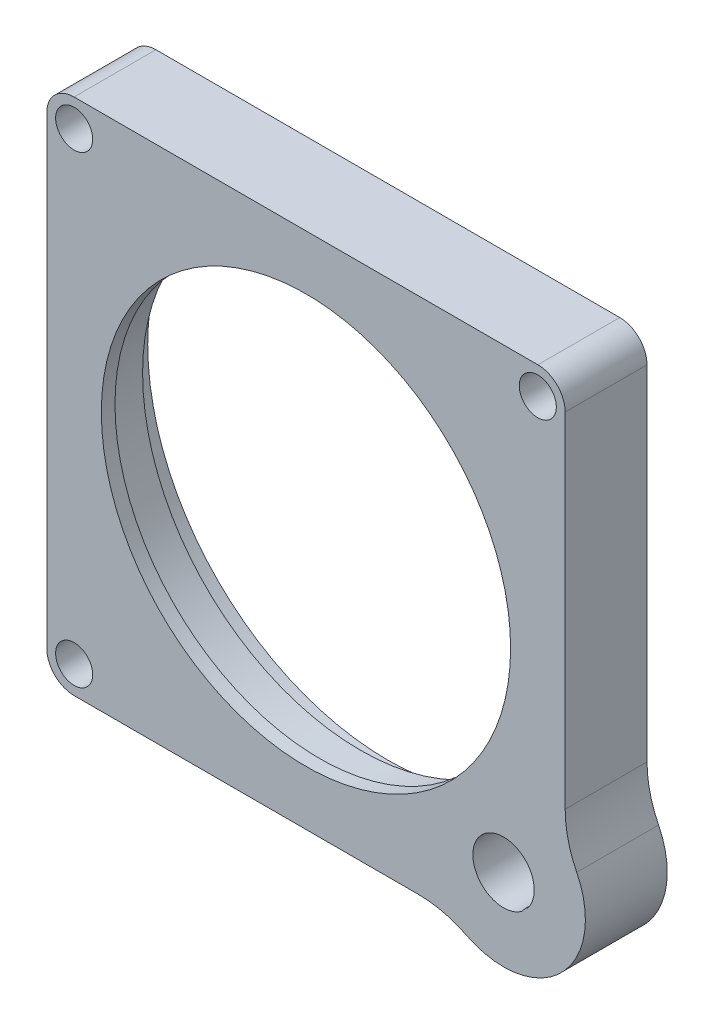
ISO-10303-21;
HEADER;
FILE_DESCRIPTION(('STEP AP214'),'2;1');
FILE_NAME('part.step','',(''),(''),'','','');
FILE_SCHEMA(('AUTOMOTIVE_DESIGN { 1 0 10303 214 1 1 1 1 }'));
ENDSEC;
DATA;
#1=APPLICATION_CONTEXT('core data for automotive mechanical design processes');
#2=APPLICATION_PROTOCOL_DEFINITION('international standard','automotive_design',2000,#1);
#3=PRODUCT_CONTEXT('',#1,'mechanical');
#4=PRODUCT('Part','Part','',(#3));
#5=PRODUCT_RELATED_PRODUCT_CATEGORY('part','',(#4));
#6=PRODUCT_DEFINITION_FORMATION('','',#4);
#7=PRODUCT_DEFINITION_CONTEXT('part definition',#1,'design');
#8=PRODUCT_DEFINITION('design','',#6,#7);
#9=PRODUCT_DEFINITION_SHAPE('','',#8);
#10=(LENGTH_UNIT() NAMED_UNIT(*) SI_UNIT(.MILLI.,.METRE.));
#11=(NAMED_UNIT(*) PLANE_ANGLE_UNIT() SI_UNIT($,.RADIAN.));
#12=(NAMED_UNIT(*) SI_UNIT($,.STERADIAN.) SOLID_ANGLE_UNIT());
#13=UNCERTAINTY_MEASURE_WITH_UNIT(LENGTH_MEASURE(1.E-05),#10,'distance_accuracy_value','');
#14=(GEOMETRIC_REPRESENTATION_CONTEXT(3) GLOBAL_UNCERTAINTY_ASSIGNED_CONTEXT((#13)) GLOBAL_UNIT_ASSIGNED_CONTEXT((#10,
#11,#12)) REPRESENTATION_CONTEXT('',''));
#15=CARTESIAN_POINT('',(0.,0.,0.));
#16=DIRECTION('',(0.,0.,1.));
#17=DIRECTION('',(1.,0.,0.));
#18=AXIS2_PLACEMENT_3D('',#15,#16,#17);
#19=CARTESIAN_POINT('',(22.9894556699369,-22.9894556699372,9.525));
#20=DIRECTION('',(0.,0.,1.));
#21=DIRECTION('',(1.,0.,0.));
#22=AXIS2_PLACEMENT_3D('',#19,#20,#21);
#23=CYLINDRICAL_SURFACE('',#22,3.57124);
#24=CARTESIAN_POINT('',(22.9894556699369,-22.9894556699372,3.2004));
#25=DIRECTION('',(0.,0.,-1.));
#26=DIRECTION('',(-1.,0.,0.));
#27=AXIS2_PLACEMENT_3D('',#24,#25,#26);
#28=CIRCLE('',#27,3.57124);
#29=CARTESIAN_POINT('',(25.8437712750575,-25.1357635611692,3.2004));
#30=VERTEX_POINT('',#29);
#31=CARTESIAN_POINT('',(25.1357635611654,-25.8437712750604,3.2004));
#32=VERTEX_POINT('',#31);
#33=EDGE_CURVE('E158',#30,#32,#28,.F.);
#34=ORIENTED_EDGE('',*,*,#33,.F.);
#35=DIRECTION('',(0.,0.,1.));
#36=VECTOR('',#35,1.);
#37=CARTESIAN_POINT('',(25.8437712750575,-25.1357635611692,4.7625));
#38=LINE('',#37,#36);
#39=CARTESIAN_POINT('',(25.8437712750575,-25.1357635611692,9.525));
#40=VERTEX_POINT('',#39);
#41=EDGE_CURVE('E166',#30,#40,#38,.T.);
#42=ORIENTED_EDGE('',*,*,#41,.T.);
#43=CARTESIAN_POINT('',(22.9894556699369,-22.9894556699372,9.525));
#44=DIRECTION('',(0.,0.,1.));
#45=DIRECTION('',(1.,0.,0.));
#46=AXIS2_PLACEMENT_3D('',#43,#44,#45);
#47=CIRCLE('',#46,3.57124);
#48=CARTESIAN_POINT('',(25.1357635611654,-25.8437712750604,9.525));
#49=VERTEX_POINT('',#48);
#50=EDGE_CURVE('E180',#40,#49,#47,.T.);
#51=ORIENTED_EDGE('',*,*,#50,.T.);
#52=DIRECTION('',(0.,0.,1.));
#53=VECTOR('',#52,1.);
#54=CARTESIAN_POINT('',(25.1357635611654,-25.8437712750604,4.7625));
#55=LINE('',#54,#53);
#56=EDGE_CURVE('E168',#49,#32,#55,.F.);
#57=ORIENTED_EDGE('',*,*,#56,.T.);
#58=EDGE_LOOP('',(#34,#42,#51,#57));
#59=FACE_BOUND('',#58,.T.);
#60=ADVANCED_FACE('F44',(#59),#23,.F.);
#61=CARTESIAN_POINT('',(26.9747999999981,-26.9748000000032,0.));
#62=DIRECTION('',(0.,0.,1.));
#63=DIRECTION('',(1.,0.,0.));
#64=AXIS2_PLACEMENT_3D('',#61,#62,#63);
#65=CYLINDRICAL_SURFACE('',#64,2.159);
#66=ORIENTED_EDGE('',*,*,#41,.F.);
#67=CARTESIAN_POINT('',(26.9747999999981,-26.9748000000032,3.2004));
#68=DIRECTION('',(0.,0.,-1.));
#69=DIRECTION('',(-1.,0.,0.));
#70=AXIS2_PLACEMENT_3D('',#67,#68,#69);
#71=CIRCLE('',#70,2.159);
#72=EDGE_CURVE('E155',#30,#32,#71,.F.);
#73=ORIENTED_EDGE('',*,*,#72,.T.);
#74=ORIENTED_EDGE('',*,*,#56,.F.);
#75=CARTESIAN_POINT('',(26.9747999999981,-26.9748000000032,9.525));
#76=DIRECTION('',(0.,0.,1.));
#77=DIRECTION('',(1.,0.,0.));
#78=AXIS2_PLACEMENT_3D('',#75,#76,#77);
#79=CIRCLE('',#78,2.159);
#80=EDGE_CURVE('E173',#40,#49,#79,.T.);
#81=ORIENTED_EDGE('',*,*,#80,.F.);
#82=EDGE_LOOP('',(#66,#73,#74,#81));
#83=FACE_BOUND('',#82,.T.);
#84=ADVANCED_FACE('F171',(#83),#65,.T.);
#85=CARTESIAN_POINT('',(0.,0.,81.1874438461319));
#86=DIRECTION('',(0.,0.,-1.));
#87=DIRECTION('',(-1.,0.,0.));
#88=AXIS2_PLACEMENT_3D('',#85,#86,#87);
#89=CYLINDRICAL_SURFACE('',#88,25.3365);
#90=CARTESIAN_POINT('',(0.,0.,7.9375));
#91=DIRECTION('',(0.,0.,1.));
#92=DIRECTION('',(1.,0.,0.));
#93=AXIS2_PLACEMENT_3D('',#90,#91,#92);
#94=CIRCLE('',#93,25.3365);
#95=CARTESIAN_POINT('',(25.3365,0.,7.9375));
#96=VERTEX_POINT('',#95);
#97=EDGE_CURVE('E250',#96,#96,#94,.F.);
#98=ORIENTED_EDGE('',*,*,#97,.F.);
#99=EDGE_LOOP('',(#98));
#100=FACE_BOUND('',#99,.T.);
#101=CARTESIAN_POINT('',(0.,0.,3.20040000000001));
#102=DIRECTION('',(0.,0.,-1.));
#103=DIRECTION('',(-1.,0.,0.));
#104=AXIS2_PLACEMENT_3D('',#101,#102,#103);
#105=CIRCLE('',#104,25.3365);
#106=CARTESIAN_POINT('',(-25.3365,0.,3.20040000000001));
#107=VERTEX_POINT('',#106);
#108=EDGE_CURVE('E254',#107,#107,#105,.F.);
#109=ORIENTED_EDGE('',*,*,#108,.F.);
#110=EDGE_LOOP('',(#109));
#111=FACE_BOUND('',#110,.T.);
#112=ADVANCED_FACE('F361',(#100,#111),#89,.F.);
#113=CARTESIAN_POINT('',(26.9875000000011,26.9875,9.525));
#114=DIRECTION('',(0.,0.,-1.));
#115=DIRECTION('',(-1.,0.,0.));
#116=AXIS2_PLACEMENT_3D('',#113,#114,#115);
#117=CYLINDRICAL_SURFACE('',#116,3.175);
#118=CARTESIAN_POINT('',(26.9875000000011,26.9875,0.));
#119=DIRECTION('',(0.,0.,1.));
#120=DIRECTION('',(1.,0.,0.));
#121=AXIS2_PLACEMENT_3D('',#118,#119,#120);
#122=CIRCLE('',#121,3.175);
#123=CARTESIAN_POINT('',(26.9875000000011,30.1625,0.));
#124=VERTEX_POINT('',#123);
#125=CARTESIAN_POINT('',(30.1625000000011,26.9875,0.));
#126=VERTEX_POINT('',#125);
#127=EDGE_CURVE('E185',#124,#126,#122,.F.);
#128=ORIENTED_EDGE('',*,*,#127,.F.);
#129=DIRECTION('',(0.,0.,-1.));
#130=VECTOR('',#129,1.);
#131=CARTESIAN_POINT('',(26.9875000000011,30.1625,9.525));
#132=LINE('',#131,#130);
#133=CARTESIAN_POINT('',(26.9875000000011,30.1625,9.525));
#134=VERTEX_POINT('',#133);
#135=EDGE_CURVE('E248',#134,#124,#132,.T.);
#136=ORIENTED_EDGE('',*,*,#135,.F.);
#137=CARTESIAN_POINT('',(26.9875000000011,26.9875,9.525));
#138=DIRECTION('',(0.,0.,1.));
#139=DIRECTION('',(1.,0.,0.));
#140=AXIS2_PLACEMENT_3D('',#137,#138,#139);
#141=CIRCLE('',#140,3.175);
#142=CARTESIAN_POINT('',(30.1625000000011,26.9875,9.525));
#143=VERTEX_POINT('',#142);
#144=EDGE_CURVE('E187',#134,#143,#141,.F.);
#145=ORIENTED_EDGE('',*,*,#144,.T.);
#146=DIRECTION('',(0.,0.,-1.));
#147=VECTOR('',#146,1.);
#148=CARTESIAN_POINT('',(30.1625000000011,26.9875,9.525));
#149=LINE('',#148,#147);
#150=EDGE_CURVE('E213',#143,#126,#149,.T.);
#151=ORIENTED_EDGE('',*,*,#150,.T.);
#152=EDGE_LOOP('',(#128,#136,#145,#151));
#153=FACE_BOUND('',#152,.T.);
#154=ADVANCED_FACE('F478',(#153),#117,.T.);
#155=CARTESIAN_POINT('',(0.,30.1625,9.525));
#156=DIRECTION('',(0.,1.,0.));
#157=DIRECTION('',(0.,0.,1.));
#158=AXIS2_PLACEMENT_3D('',#155,#156,#157);
#159=PLANE('',#158);
#160=DIRECTION('',(1.,0.,0.));
#161=VECTOR('',#160,1.);
#162=CARTESIAN_POINT('',(0.,30.1625,0.));
#163=LINE('',#162,#161);
#164=CARTESIAN_POINT('',(-26.9875000000011,30.1625,0.));
#165=VERTEX_POINT('',#164);
#166=EDGE_CURVE('E216',#165,#124,#163,.T.);
#167=ORIENTED_EDGE('',*,*,#166,.F.);
#168=DIRECTION('',(0.,0.,-1.));
#169=VECTOR('',#168,1.);
#170=CARTESIAN_POINT('',(-26.9875000000011,30.1625,9.525));
#171=LINE('',#170,#169);
#172=CARTESIAN_POINT('',(-26.9875000000011,30.1625,9.525));
#173=VERTEX_POINT('',#172);
#174=EDGE_CURVE('E246',#173,#165,#171,.T.);
#175=ORIENTED_EDGE('',*,*,#174,.F.);
#176=DIRECTION('',(1.,0.,0.));
#177=VECTOR('',#176,1.);
#178=CARTESIAN_POINT('',(0.,30.1625,9.525));
#179=LINE('',#178,#177);
#180=EDGE_CURVE('E190',#173,#134,#179,.T.);
#181=ORIENTED_EDGE('',*,*,#180,.T.);
#182=ORIENTED_EDGE('',*,*,#135,.T.);
#183=EDGE_LOOP('',(#167,#175,#181,#182));
#184=FACE_BOUND('',#183,.T.);
#185=ADVANCED_FACE('F475',(#184),#159,.T.);
#186=CARTESIAN_POINT('',(-26.9875000000011,26.9875,9.525));
#187=DIRECTION('',(0.,0.,-1.));
#188=DIRECTION('',(-1.,0.,0.));
#189=AXIS2_PLACEMENT_3D('',#186,#187,#188);
#190=CYLINDRICAL_SURFACE('',#189,3.175);
#191=CARTESIAN_POINT('',(-26.9875000000011,26.9875,0.));
#192=DIRECTION('',(0.,0.,1.));
#193=DIRECTION('',(1.,0.,0.));
#194=AXIS2_PLACEMENT_3D('',#191,#192,#193);
#195=CIRCLE('',#194,3.175);
#196=CARTESIAN_POINT('',(-30.1625000000011,26.9875,0.));
#197=VERTEX_POINT('',#196);
#198=EDGE_CURVE('E219',#165,#197,#195,.T.);
#199=ORIENTED_EDGE('',*,*,#198,.T.);
#200=DIRECTION('',(0.,0.,-1.));
#201=VECTOR('',#200,1.);
#202=CARTESIAN_POINT('',(-30.1625000000011,26.9875,9.525));
#203=LINE('',#202,#201);
#204=CARTESIAN_POINT('',(-30.1625000000011,26.9875,9.525));
#205=VERTEX_POINT('',#204);
#206=EDGE_CURVE('E243',#205,#197,#203,.T.);
#207=ORIENTED_EDGE('',*,*,#206,.F.);
#208=CARTESIAN_POINT('',(-26.9875000000011,26.9875,9.525));
#209=DIRECTION('',(0.,0.,1.));
#210=DIRECTION('',(1.,0.,0.));
#211=AXIS2_PLACEMENT_3D('',#208,#209,#210);
#212=CIRCLE('',#211,3.175);
#213=EDGE_CURVE('E194',#173,#205,#212,.T.);
#214=ORIENTED_EDGE('',*,*,#213,.F.);
#215=ORIENTED_EDGE('',*,*,#174,.T.);
#216=EDGE_LOOP('',(#199,#207,#214,#215));
#217=FACE_BOUND('',#216,.T.);
#218=ADVANCED_FACE('F472',(#217),#190,.T.);
#219=CARTESIAN_POINT('',(-30.1625000000011,0.,9.525));
#220=DIRECTION('',(1.,0.,0.));
#221=DIRECTION('',(0.,0.,-1.));
#222=AXIS2_PLACEMENT_3D('',#219,#220,#221);
#223=PLANE('',#222);
#224=DIRECTION('',(0.,-1.,0.));
#225=VECTOR('',#224,1.);
#226=CARTESIAN_POINT('',(-30.1625000000011,0.,0.));
#227=LINE('',#226,#225);
#228=CARTESIAN_POINT('',(-30.1625000000011,-26.9875,0.));
#229=VERTEX_POINT('',#228);
#230=EDGE_CURVE('E221',#197,#229,#227,.T.);
#231=ORIENTED_EDGE('',*,*,#230,.T.);
#232=DIRECTION('',(0.,0.,-1.));
#233=VECTOR('',#232,1.);
#234=CARTESIAN_POINT('',(-30.1625000000011,-26.9875,9.525));
#235=LINE('',#234,#233);
#236=CARTESIAN_POINT('',(-30.1625000000011,-26.9875,9.525));
#237=VERTEX_POINT('',#236);
#238=EDGE_CURVE('E241',#237,#229,#235,.T.);
#239=ORIENTED_EDGE('',*,*,#238,.F.);
#240=DIRECTION('',(0.,-1.,0.));
#241=VECTOR('',#240,1.);
#242=CARTESIAN_POINT('',(-30.1625000000011,0.,9.525));
#243=LINE('',#242,#241);
#244=EDGE_CURVE('E196',#205,#237,#243,.T.);
#245=ORIENTED_EDGE('',*,*,#244,.F.);
#246=ORIENTED_EDGE('',*,*,#206,.T.);
#247=EDGE_LOOP('',(#231,#239,#245,#246));
#248=FACE_BOUND('',#247,.T.);
#249=ADVANCED_FACE('F467',(#248),#223,.F.);
#250=CARTESIAN_POINT('',(-26.9875000000011,-26.9875,9.525));
#251=DIRECTION('',(0.,0.,-1.));
#252=DIRECTION('',(-1.,0.,0.));
#253=AXIS2_PLACEMENT_3D('',#250,#251,#252);
#254=CYLINDRICAL_SURFACE('',#253,3.175);
#255=CARTESIAN_POINT('',(-26.9875000000011,-26.9875,0.));
#256=DIRECTION('',(0.,0.,1.));
#257=DIRECTION('',(1.,0.,0.));
#258=AXIS2_PLACEMENT_3D('',#255,#256,#257);
#259=CIRCLE('',#258,3.175);
#260=CARTESIAN_POINT('',(-26.9875000000011,-30.1625,0.));
#261=VERTEX_POINT('',#260);
#262=EDGE_CURVE('E224',#261,#229,#259,.F.);
#263=ORIENTED_EDGE('',*,*,#262,.F.);
#264=DIRECTION('',(0.,0.,-1.));
#265=VECTOR('',#264,1.);
#266=CARTESIAN_POINT('',(-26.9875000000011,-30.1625,9.525));
#267=LINE('',#266,#265);
#268=CARTESIAN_POINT('',(-26.9875000000011,-30.1625,9.525));
#269=VERTEX_POINT('',#268);
#270=EDGE_CURVE('E239',#269,#261,#267,.T.);
#271=ORIENTED_EDGE('',*,*,#270,.F.);
#272=CARTESIAN_POINT('',(-26.9875000000011,-26.9875,9.525));
#273=DIRECTION('',(0.,0.,1.));
#274=DIRECTION('',(1.,0.,0.));
#275=AXIS2_PLACEMENT_3D('',#272,#273,#274);
#276=CIRCLE('',#275,3.175);
#277=EDGE_CURVE('E198',#269,#237,#276,.F.);
#278=ORIENTED_EDGE('',*,*,#277,.T.);
#279=ORIENTED_EDGE('',*,*,#238,.T.);
#280=EDGE_LOOP('',(#263,#271,#278,#279));
#281=FACE_BOUND('',#280,.T.);
#282=ADVANCED_FACE('F461',(#281),#254,.T.);
#283=CARTESIAN_POINT('',(0.,-30.1625,9.525));
#284=DIRECTION('',(0.,1.,0.));
#285=DIRECTION('',(0.,0.,1.));
#286=AXIS2_PLACEMENT_3D('',#283,#284,#285);
#287=PLANE('',#286);
#288=DIRECTION('',(1.,0.,0.));
#289=VECTOR('',#288,1.);
#290=CARTESIAN_POINT('',(0.,-30.1625,0.));
#291=LINE('',#290,#289);
#292=CARTESIAN_POINT('',(13.038941409088,-30.1625,0.));
#293=VERTEX_POINT('',#292);
#294=EDGE_CURVE('E227',#261,#293,#291,.T.);
#295=ORIENTED_EDGE('',*,*,#294,.T.);
#296=DIRECTION('',(0.,0.,-1.));
#297=VECTOR('',#296,1.);
#298=CARTESIAN_POINT('',(13.038941409088,-30.1625,9.525));
#299=LINE('',#298,#297);
#300=CARTESIAN_POINT('',(13.038941409088,-30.1625,9.525));
#301=VERTEX_POINT('',#300);
#302=EDGE_CURVE('E263',#293,#301,#299,.F.);
#303=ORIENTED_EDGE('',*,*,#302,.T.);
#304=DIRECTION('',(1.,0.,0.));
#305=VECTOR('',#304,1.);
#306=CARTESIAN_POINT('',(0.,-30.1625,9.525));
#307=LINE('',#306,#305);
#308=EDGE_CURVE('E201',#269,#301,#307,.T.);
#309=ORIENTED_EDGE('',*,*,#308,.F.);
#310=ORIENTED_EDGE('',*,*,#270,.T.);
#311=EDGE_LOOP('',(#295,#303,#309,#310));
#312=FACE_BOUND('',#311,.T.);
#313=ADVANCED_FACE('F459',(#312),#287,.F.);
#314=CARTESIAN_POINT('',(-26.9748000000013,26.9748,9.525));
#315=DIRECTION('',(0.,0.,-1.));
#316=DIRECTION('',(-1.,0.,0.));
#317=AXIS2_PLACEMENT_3D('',#314,#315,#316);
#318=CYLINDRICAL_SURFACE('',#317,2.159);
#319=CARTESIAN_POINT('',(-26.9748000000013,26.9748,9.525));
#320=DIRECTION('',(0.,0.,1.));
#321=DIRECTION('',(1.,0.,0.));
#322=AXIS2_PLACEMENT_3D('',#319,#320,#321);
#323=CIRCLE('',#322,2.159);
#324=CARTESIAN_POINT('',(-24.8158000000013,26.9748,9.525));
#325=VERTEX_POINT('',#324);
#326=EDGE_CURVE('E210',#325,#325,#323,.T.);
#327=ORIENTED_EDGE('',*,*,#326,.T.);
#328=EDGE_LOOP('',(#327));
#329=FACE_BOUND('',#328,.T.);
#330=CARTESIAN_POINT('',(-26.9748000000013,26.9748,0.));
#331=DIRECTION('',(0.,0.,1.));
#332=DIRECTION('',(1.,0.,0.));
#333=AXIS2_PLACEMENT_3D('',#330,#331,#332);
#334=CIRCLE('',#333,2.159);
#335=CARTESIAN_POINT('',(-24.8158000000013,26.9748,0.));
#336=VERTEX_POINT('',#335);
#337=EDGE_CURVE('E191',#336,#336,#334,.T.);
#338=ORIENTED_EDGE('',*,*,#337,.F.);
#339=EDGE_LOOP('',(#338));
#340=FACE_BOUND('',#339,.T.);
#341=ADVANCED_FACE('F645',(#329,#340),#318,.F.);
#342=CARTESIAN_POINT('',(26.9748000000016,26.9747999999997,9.525));
#343=DIRECTION('',(0.,0.,-1.));
#344=DIRECTION('',(-1.,0.,0.));
#345=AXIS2_PLACEMENT_3D('',#342,#343,#344);
#346=CYLINDRICAL_SURFACE('',#345,2.15900000000011);
#347=CARTESIAN_POINT('',(26.9748000000016,26.9747999999997,9.525));
#348=DIRECTION('',(0.,0.,1.));
#349=DIRECTION('',(1.,0.,0.));
#350=AXIS2_PLACEMENT_3D('',#347,#348,#349);
#351=CIRCLE('',#350,2.15900000000011);
#352=CARTESIAN_POINT('',(29.1338000000017,26.9747999999997,9.525));
#353=VERTEX_POINT('',#352);
#354=EDGE_CURVE('E207',#353,#353,#351,.T.);
#355=ORIENTED_EDGE('',*,*,#354,.T.);
#356=EDGE_LOOP('',(#355));
#357=FACE_BOUND('',#356,.T.);
#358=CARTESIAN_POINT('',(26.9748000000016,26.9747999999997,0.));
#359=DIRECTION('',(0.,0.,1.));
#360=DIRECTION('',(1.,0.,0.));
#361=AXIS2_PLACEMENT_3D('',#358,#359,#360);
#362=CIRCLE('',#361,2.15900000000011);
#363=CARTESIAN_POINT('',(29.1338000000017,26.9747999999997,0.));
#364=VERTEX_POINT('',#363);
#365=EDGE_CURVE('E233',#364,#364,#362,.T.);
#366=ORIENTED_EDGE('',*,*,#365,.F.);
#367=EDGE_LOOP('',(#366));
#368=FACE_BOUND('',#367,.T.);
#369=ADVANCED_FACE('F640',(#357,#368),#346,.F.);
#370=CARTESIAN_POINT('',(30.1625000000011,0.,9.525));
#371=DIRECTION('',(1.,0.,0.));
#372=DIRECTION('',(0.,0.,-1.));
#373=AXIS2_PLACEMENT_3D('',#370,#371,#372);
#374=PLANE('',#373);
#375=DIRECTION('',(0.,-1.,0.));
#376=VECTOR('',#375,1.);
#377=CARTESIAN_POINT('',(30.1625000000011,0.,9.525));
#378=LINE('',#377,#376);
#379=CARTESIAN_POINT('',(30.1625000000011,-13.038941409091,9.525));
#380=VERTEX_POINT('',#379);
#381=EDGE_CURVE('E204',#143,#380,#378,.T.);
#382=ORIENTED_EDGE('',*,*,#381,.T.);
#383=DIRECTION('',(0.,0.,1.));
#384=VECTOR('',#383,1.);
#385=CARTESIAN_POINT('',(30.1625000000011,-13.038941409091,0.));
#386=LINE('',#385,#384);
#387=CARTESIAN_POINT('',(30.1625000000011,-13.038941409091,0.));
#388=VERTEX_POINT('',#387);
#389=EDGE_CURVE('E265',#380,#388,#386,.F.);
#390=ORIENTED_EDGE('',*,*,#389,.T.);
#391=DIRECTION('',(0.,-1.,0.));
#392=VECTOR('',#391,1.);
#393=CARTESIAN_POINT('',(30.1625000000011,0.,0.));
#394=LINE('',#393,#392);
#395=EDGE_CURVE('E230',#126,#388,#394,.T.);
#396=ORIENTED_EDGE('',*,*,#395,.F.);
#397=ORIENTED_EDGE('',*,*,#150,.F.);
#398=EDGE_LOOP('',(#382,#390,#396,#397));
#399=FACE_BOUND('',#398,.T.);
#400=ADVANCED_FACE('F332',(#399),#374,.T.);
#401=CARTESIAN_POINT('',(0.,0.,9.525));
#402=DIRECTION('',(0.,0.,1.));
#403=DIRECTION('',(1.,0.,0.));
#404=AXIS2_PLACEMENT_3D('',#401,#402,#403);
#405=PLANE('',#404);
#406=ORIENTED_EDGE('',*,*,#308,.T.);
#407=CARTESIAN_POINT('',(13.038941409088,-42.8625,9.525));
#408=DIRECTION('',(0.,0.,1.));
#409=DIRECTION('',(1.,0.,0.));
#410=AXIS2_PLACEMENT_3D('',#407,#408,#409);
#411=CIRCLE('',#410,12.7);
#412=CARTESIAN_POINT('',(18.7249495581445,-31.5064746685355,9.525));
#413=VERTEX_POINT('',#412);
#414=EDGE_CURVE('E270',#301,#413,#411,.F.);
#415=ORIENTED_EDGE('',*,*,#414,.T.);
#416=CARTESIAN_POINT('',(22.9894556699369,-22.9894556699371,9.525));
#417=DIRECTION('',(0.,0.,1.));
#418=DIRECTION('',(1.,0.,0.));
#419=AXIS2_PLACEMENT_3D('',#416,#417,#418);
#420=CIRCLE('',#419,9.525);
#421=CARTESIAN_POINT('',(31.5064746685359,-18.7249495581459,9.525));
#422=VERTEX_POINT('',#421);
#423=EDGE_CURVE('E319',#422,#413,#420,.F.);
#424=ORIENTED_EDGE('',*,*,#423,.F.);
#425=CARTESIAN_POINT('',(42.8625000000011,-13.038941409091,9.525));
#426=DIRECTION('',(0.,0.,1.));
#427=DIRECTION('',(1.,0.,0.));
#428=AXIS2_PLACEMENT_3D('',#425,#426,#427);
#429=CIRCLE('',#428,12.7);
#430=EDGE_CURVE('E274',#422,#380,#429,.F.);
#431=ORIENTED_EDGE('',*,*,#430,.T.);
#432=ORIENTED_EDGE('',*,*,#381,.F.);
#433=ORIENTED_EDGE('',*,*,#144,.F.);
#434=ORIENTED_EDGE('',*,*,#180,.F.);
#435=ORIENTED_EDGE('',*,*,#213,.T.);
#436=ORIENTED_EDGE('',*,*,#244,.T.);
#437=ORIENTED_EDGE('',*,*,#277,.F.);
#438=EDGE_LOOP('',(#406,#415,#424,#431,#432,#433,#434,#435,#436,#437));
#439=FACE_BOUND('',#438,.T.);
#440=CARTESIAN_POINT('',(-26.9748000000013,-26.9748000000032,9.525));
#441=DIRECTION('',(0.,0.,1.));
#442=DIRECTION('',(1.,0.,0.));
#443=AXIS2_PLACEMENT_3D('',#440,#441,#442);
#444=CIRCLE('',#443,2.159);
#445=CARTESIAN_POINT('',(-24.8158000000013,-26.9748000000032,9.525));
#446=VERTEX_POINT('',#445);
#447=EDGE_CURVE('E257',#446,#446,#444,.T.);
#448=ORIENTED_EDGE('',*,*,#447,.F.);
#449=EDGE_LOOP('',(#448));
#450=FACE_BOUND('',#449,.T.);
#451=ORIENTED_EDGE('',*,*,#50,.F.);
#452=ORIENTED_EDGE('',*,*,#80,.T.);
#453=EDGE_LOOP('',(#451,#452));
#454=FACE_BOUND('',#453,.T.);
#455=ORIENTED_EDGE('',*,*,#354,.F.);
#456=EDGE_LOOP('',(#455));
#457=FACE_BOUND('',#456,.T.);
#458=ORIENTED_EDGE('',*,*,#326,.F.);
#459=EDGE_LOOP('',(#458));
#460=FACE_BOUND('',#459,.T.);
#461=CARTESIAN_POINT('',(0.,0.,9.525));
#462=DIRECTION('',(0.,0.,1.));
#463=DIRECTION('',(1.,0.,0.));
#464=AXIS2_PLACEMENT_3D('',#461,#462,#463);
#465=CIRCLE('',#464,23.8125);
#466=CARTESIAN_POINT('',(23.8125,0.,9.525));
#467=VERTEX_POINT('',#466);
#468=EDGE_CURVE('E175',#467,#467,#465,.T.);
#469=ORIENTED_EDGE('',*,*,#468,.F.);
#470=EDGE_LOOP('',(#469));
#471=FACE_BOUND('',#470,.T.);
#472=ADVANCED_FACE('F329',(#439,#450,#454,#457,#460,#471),#405,.T.);
#473=CARTESIAN_POINT('',(0.,0.,0.));
#474=DIRECTION('',(0.,0.,1.));
#475=DIRECTION('',(1.,0.,0.));
#476=AXIS2_PLACEMENT_3D('',#473,#474,#475);
#477=PLANE('',#476);
#478=CARTESIAN_POINT('',(25.4059395990748,16.1161984131223,0.));
#479=DIRECTION('',(0.,0.,-1.));
#480=DIRECTION('',(-1.,0.,0.));
#481=AXIS2_PLACEMENT_3D('',#478,#479,#480);
#482=CIRCLE('',#481,1.63830000000001);
#483=CARTESIAN_POINT('',(23.7676395990748,16.1161984131223,0.));
#484=VERTEX_POINT('',#483);
#485=EDGE_CURVE('E313',#484,#484,#482,.T.);
#486=ORIENTED_EDGE('',*,*,#485,.F.);
#487=EDGE_LOOP('',(#486));
#488=FACE_BOUND('',#487,.T.);
#489=CARTESIAN_POINT('',(-25.405939599075,16.1161984131221,0.));
#490=DIRECTION('',(0.,0.,-1.));
#491=DIRECTION('',(-1.,0.,0.));
#492=AXIS2_PLACEMENT_3D('',#489,#490,#491);
#493=CIRCLE('',#492,1.63830000000001);
#494=CARTESIAN_POINT('',(-27.044239599075,16.1161984131221,0.));
#495=VERTEX_POINT('',#494);
#496=EDGE_CURVE('E309',#495,#495,#493,.T.);
#497=ORIENTED_EDGE('',*,*,#496,.F.);
#498=EDGE_LOOP('',(#497));
#499=FACE_BOUND('',#498,.T.);
#500=ORIENTED_EDGE('',*,*,#395,.T.);
#501=CARTESIAN_POINT('',(42.8625000000011,-13.038941409091,0.));
#502=DIRECTION('',(0.,0.,1.));
#503=DIRECTION('',(1.,0.,0.));
#504=AXIS2_PLACEMENT_3D('',#501,#502,#503);
#505=CIRCLE('',#504,12.7);
#506=CARTESIAN_POINT('',(31.5064746685359,-18.7249495581459,0.));
#507=VERTEX_POINT('',#506);
#508=EDGE_CURVE('E272',#388,#507,#505,.T.);
#509=ORIENTED_EDGE('',*,*,#508,.T.);
#510=CARTESIAN_POINT('',(22.9894556699369,-22.9894556699371,0.));
#511=DIRECTION('',(0.,0.,-1.));
#512=DIRECTION('',(-1.,0.,0.));
#513=AXIS2_PLACEMENT_3D('',#510,#511,#512);
#514=CIRCLE('',#513,9.525);
#515=CARTESIAN_POINT('',(18.7249495581445,-31.5064746685355,0.));
#516=VERTEX_POINT('',#515);
#517=EDGE_CURVE('E169',#507,#516,#514,.T.);
#518=ORIENTED_EDGE('',*,*,#517,.T.);
#519=CARTESIAN_POINT('',(13.038941409088,-42.8625,0.));
#520=DIRECTION('',(0.,0.,1.));
#521=DIRECTION('',(1.,0.,0.));
#522=AXIS2_PLACEMENT_3D('',#519,#520,#521);
#523=CIRCLE('',#522,12.7);
#524=EDGE_CURVE('E268',#516,#293,#523,.T.);
#525=ORIENTED_EDGE('',*,*,#524,.T.);
#526=ORIENTED_EDGE('',*,*,#294,.F.);
#527=ORIENTED_EDGE('',*,*,#262,.T.);
#528=ORIENTED_EDGE('',*,*,#230,.F.);
#529=ORIENTED_EDGE('',*,*,#198,.F.);
#530=ORIENTED_EDGE('',*,*,#166,.T.);
#531=ORIENTED_EDGE('',*,*,#127,.T.);
#532=EDGE_LOOP('',(#500,#509,#518,#525,#526,#527,#528,#529,#530,#531));
#533=FACE_BOUND('',#532,.T.);
#534=CARTESIAN_POINT('',(0.,0.,0.));
#535=DIRECTION('',(0.,0.,-1.));
#536=DIRECTION('',(-1.,0.,0.));
#537=AXIS2_PLACEMENT_3D('',#534,#535,#536);
#538=CIRCLE('',#537,27.94);
#539=CARTESIAN_POINT('',(9.77872567431285,-26.1728891066029,0.));
#540=VERTEX_POINT('',#539);
#541=CARTESIAN_POINT('',(26.1728891066028,-9.77872567431312,0.));
#542=VERTEX_POINT('',#541);
#543=EDGE_CURVE('E298',#540,#542,#538,.T.);
#544=ORIENTED_EDGE('',*,*,#543,.F.);
#545=CARTESIAN_POINT('',(12.0011633275658,-32.1212729944672,0.));
#546=DIRECTION('',(0.,0.,1.));
#547=DIRECTION('',(1.,0.,0.));
#548=AXIS2_PLACEMENT_3D('',#545,#546,#547);
#549=CIRCLE('',#548,6.35);
#550=CARTESIAN_POINT('',(16.8848488130641,-28.0626875168983,0.));
#551=VERTEX_POINT('',#550);
#552=EDGE_CURVE('E284',#540,#551,#549,.F.);
#553=ORIENTED_EDGE('',*,*,#552,.T.);
#554=CARTESIAN_POINT('',(22.9894556699369,-22.9894556699372,0.));
#555=DIRECTION('',(0.,0.,-1.));
#556=DIRECTION('',(-1.,0.,0.));
#557=AXIS2_PLACEMENT_3D('',#554,#555,#556);
#558=CIRCLE('',#557,7.9375);
#559=CARTESIAN_POINT('',(28.0626875168981,-16.8848488130643,0.));
#560=VERTEX_POINT('',#559);
#561=EDGE_CURVE('E305',#560,#551,#558,.T.);
#562=ORIENTED_EDGE('',*,*,#561,.F.);
#563=CARTESIAN_POINT('',(32.1212729944671,-12.0011633275661,0.));
#564=DIRECTION('',(0.,0.,1.));
#565=DIRECTION('',(1.,0.,0.));
#566=AXIS2_PLACEMENT_3D('',#563,#564,#565);
#567=CIRCLE('',#566,6.35);
#568=EDGE_CURVE('E282',#560,#542,#567,.F.);
#569=ORIENTED_EDGE('',*,*,#568,.T.);
#570=EDGE_LOOP('',(#544,#553,#562,#569));
#571=FACE_BOUND('',#570,.T.);
#572=CARTESIAN_POINT('',(-26.9748000000013,-26.9748000000032,0.));
#573=DIRECTION('',(0.,0.,1.));
#574=DIRECTION('',(1.,0.,0.));
#575=AXIS2_PLACEMENT_3D('',#572,#573,#574);
#576=CIRCLE('',#575,2.159);
#577=CARTESIAN_POINT('',(-24.8158000000013,-26.9748000000032,0.));
#578=VERTEX_POINT('',#577);
#579=EDGE_CURVE('E323',#578,#578,#576,.T.);
#580=ORIENTED_EDGE('',*,*,#579,.T.);
#581=EDGE_LOOP('',(#580));
#582=FACE_BOUND('',#581,.T.);
#583=ORIENTED_EDGE('',*,*,#365,.T.);
#584=EDGE_LOOP('',(#583));
#585=FACE_BOUND('',#584,.T.);
#586=ORIENTED_EDGE('',*,*,#337,.T.);
#587=EDGE_LOOP('',(#586));
#588=FACE_BOUND('',#587,.T.);
#589=ADVANCED_FACE('F303',(#488,#499,#533,#571,#582,#585,#588),#477,.F.);
#590=CARTESIAN_POINT('',(0.,0.,7.9375));
#591=DIRECTION('',(0.,0.,1.));
#592=DIRECTION('',(1.,0.,0.));
#593=AXIS2_PLACEMENT_3D('',#590,#591,#592);
#594=PLANE('',#593);
#595=CARTESIAN_POINT('',(0.,0.,7.9375));
#596=DIRECTION('',(0.,0.,1.));
#597=DIRECTION('',(1.,0.,0.));
#598=AXIS2_PLACEMENT_3D('',#595,#596,#597);
#599=CIRCLE('',#598,23.8125);
#600=CARTESIAN_POINT('',(23.8125,0.,7.9375));
#601=VERTEX_POINT('',#600);
#602=EDGE_CURVE('E178',#601,#601,#599,.T.);
#603=ORIENTED_EDGE('',*,*,#602,.T.);
#604=EDGE_LOOP('',(#603));
#605=FACE_BOUND('',#604,.T.);
#606=ORIENTED_EDGE('',*,*,#97,.T.);
#607=EDGE_LOOP('',(#606));
#608=FACE_BOUND('',#607,.T.);
#609=ADVANCED_FACE('F344',(#605,#608),#594,.F.);
#610=CARTESIAN_POINT('',(0.,0.,7.9375));
#611=DIRECTION('',(0.,0.,1.));
#612=DIRECTION('',(1.,0.,0.));
#613=AXIS2_PLACEMENT_3D('',#610,#611,#612);
#614=CYLINDRICAL_SURFACE('',#613,23.8125);
#615=ORIENTED_EDGE('',*,*,#602,.F.);
#616=EDGE_LOOP('',(#615));
#617=FACE_BOUND('',#616,.T.);
#618=ORIENTED_EDGE('',*,*,#468,.T.);
#619=EDGE_LOOP('',(#618));
#620=FACE_BOUND('',#619,.T.);
#621=ADVANCED_FACE('F341',(#617,#620),#614,.F.);
#622=CARTESIAN_POINT('',(-26.9748000000013,-26.9748000000032,0.));
#623=DIRECTION('',(0.,0.,1.));
#624=DIRECTION('',(1.,0.,0.));
#625=AXIS2_PLACEMENT_3D('',#622,#623,#624);
#626=CYLINDRICAL_SURFACE('',#625,2.159);
#627=ORIENTED_EDGE('',*,*,#579,.F.);
#628=EDGE_LOOP('',(#627));
#629=FACE_BOUND('',#628,.T.);
#630=ORIENTED_EDGE('',*,*,#447,.T.);
#631=EDGE_LOOP('',(#630));
#632=FACE_BOUND('',#631,.T.);
#633=ADVANCED_FACE('F343',(#629,#632),#626,.F.);
#634=CARTESIAN_POINT('',(0.,0.,3.2004));
#635=DIRECTION('',(0.,0.,-1.));
#636=DIRECTION('',(-1.,0.,0.));
#637=AXIS2_PLACEMENT_3D('',#634,#635,#636);
#638=PLANE('',#637);
#639=CARTESIAN_POINT('',(22.9894556699369,-22.9894556699372,3.2004));
#640=DIRECTION('',(0.,0.,-1.));
#641=DIRECTION('',(-1.,0.,0.));
#642=AXIS2_PLACEMENT_3D('',#639,#640,#641);
#643=CIRCLE('',#642,7.9375);
#644=CARTESIAN_POINT('',(16.8848488130641,-28.0626875168983,3.2004));
#645=VERTEX_POINT('',#644);
#646=CARTESIAN_POINT('',(28.0626875168981,-16.8848488130643,3.2004));
#647=VERTEX_POINT('',#646);
#648=EDGE_CURVE('E162',#645,#647,#643,.F.);
#649=ORIENTED_EDGE('',*,*,#648,.F.);
#650=CARTESIAN_POINT('',(12.0011633275658,-32.1212729944672,3.2004));
#651=DIRECTION('',(0.,0.,-1.));
#652=DIRECTION('',(-1.,0.,0.));
#653=AXIS2_PLACEMENT_3D('',#650,#651,#652);
#654=CIRCLE('',#653,6.35);
#655=CARTESIAN_POINT('',(9.77872567431285,-26.1728891066029,3.2004));
#656=VERTEX_POINT('',#655);
#657=EDGE_CURVE('E52',#645,#656,#654,.F.);
#658=ORIENTED_EDGE('',*,*,#657,.T.);
#659=CARTESIAN_POINT('',(0.,0.,3.2004));
#660=DIRECTION('',(0.,0.,-1.));
#661=DIRECTION('',(-1.,0.,0.));
#662=AXIS2_PLACEMENT_3D('',#659,#660,#661);
#663=CIRCLE('',#662,27.94);
#664=CARTESIAN_POINT('',(26.1728891066028,-9.77872567431312,3.2004));
#665=VERTEX_POINT('',#664);
#666=EDGE_CURVE('E258',#656,#665,#663,.T.);
#667=ORIENTED_EDGE('',*,*,#666,.T.);
#668=CARTESIAN_POINT('',(32.1212729944671,-12.0011633275661,3.2004));
#669=DIRECTION('',(0.,0.,-1.));
#670=DIRECTION('',(-1.,0.,0.));
#671=AXIS2_PLACEMENT_3D('',#668,#669,#670);
#672=CIRCLE('',#671,6.35);
#673=EDGE_CURVE('E12',#665,#647,#672,.F.);
#674=ORIENTED_EDGE('',*,*,#673,.T.);
#675=EDGE_LOOP('',(#649,#658,#667,#674));
#676=FACE_BOUND('',#675,.T.);
#677=ORIENTED_EDGE('',*,*,#108,.T.);
#678=EDGE_LOOP('',(#677));
#679=FACE_BOUND('',#678,.T.);
#680=ORIENTED_EDGE('',*,*,#33,.T.);
#681=ORIENTED_EDGE('',*,*,#72,.F.);
#682=EDGE_LOOP('',(#680,#681));
#683=FACE_BOUND('',#682,.T.);
#684=ADVANCED_FACE('F157',(#676,#679,#683),#638,.T.);
#685=CARTESIAN_POINT('',(0.,0.,3.2004));
#686=DIRECTION('',(0.,0.,-1.));
#687=DIRECTION('',(-1.,0.,0.));
#688=AXIS2_PLACEMENT_3D('',#685,#686,#687);
#689=CYLINDRICAL_SURFACE('',#688,27.94);
#690=ORIENTED_EDGE('',*,*,#666,.F.);
#691=DIRECTION('',(0.,0.,-1.));
#692=VECTOR('',#691,1.);
#693=CARTESIAN_POINT('',(9.77872567431285,-26.1728891066029,3.2004));
#694=LINE('',#693,#692);
#695=EDGE_CURVE('E279',#656,#540,#694,.T.);
#696=ORIENTED_EDGE('',*,*,#695,.T.);
#697=ORIENTED_EDGE('',*,*,#543,.T.);
#698=DIRECTION('',(0.,0.,-1.));
#699=VECTOR('',#698,1.);
#700=CARTESIAN_POINT('',(26.1728891066028,-9.77872567431312,3.2004));
#701=LINE('',#700,#699);
#702=EDGE_CURVE('E276',#542,#665,#701,.F.);
#703=ORIENTED_EDGE('',*,*,#702,.T.);
#704=EDGE_LOOP('',(#690,#696,#697,#703));
#705=FACE_BOUND('',#704,.T.);
#706=ADVANCED_FACE('F294',(#705),#689,.F.);
#707=CARTESIAN_POINT('',(22.9894556699369,-22.9894556699371,31.858009079335));
#708=DIRECTION('',(0.,0.,-1.));
#709=DIRECTION('',(-1.,0.,0.));
#710=AXIS2_PLACEMENT_3D('',#707,#708,#709);
#711=CYLINDRICAL_SURFACE('',#710,9.525);
#712=ORIENTED_EDGE('',*,*,#423,.T.);
#713=DIRECTION('',(0.,0.,-1.));
#714=VECTOR('',#713,1.);
#715=CARTESIAN_POINT('',(18.7249495581445,-31.5064746685355,31.858009079335));
#716=LINE('',#715,#714);
#717=EDGE_CURVE('E260',#413,#516,#716,.T.);
#718=ORIENTED_EDGE('',*,*,#717,.T.);
#719=ORIENTED_EDGE('',*,*,#517,.F.);
#720=DIRECTION('',(0.,0.,-1.));
#721=VECTOR('',#720,1.);
#722=CARTESIAN_POINT('',(31.5064746685359,-18.7249495581459,31.858009079335));
#723=LINE('',#722,#721);
#724=EDGE_CURVE('E253',#507,#422,#723,.F.);
#725=ORIENTED_EDGE('',*,*,#724,.T.);
#726=EDGE_LOOP('',(#712,#718,#719,#725));
#727=FACE_BOUND('',#726,.T.);
#728=ADVANCED_FACE('F366',(#727),#711,.T.);
#729=CARTESIAN_POINT('',(22.9894556699369,-22.9894556699372,25.6510403026729));
#730=DIRECTION('',(0.,0.,-1.));
#731=DIRECTION('',(-1.,0.,0.));
#732=AXIS2_PLACEMENT_3D('',#729,#730,#731);
#733=CYLINDRICAL_SURFACE('',#732,7.9375);
#734=ORIENTED_EDGE('',*,*,#561,.T.);
#735=DIRECTION('',(0.,0.,-1.));
#736=VECTOR('',#735,1.);
#737=CARTESIAN_POINT('',(16.8848488130641,-28.0626875168983,25.6510403026729));
#738=LINE('',#737,#736);
#739=EDGE_CURVE('E64',#551,#645,#738,.F.);
#740=ORIENTED_EDGE('',*,*,#739,.T.);
#741=ORIENTED_EDGE('',*,*,#648,.T.);
#742=DIRECTION('',(0.,0.,-1.));
#743=VECTOR('',#742,1.);
#744=CARTESIAN_POINT('',(28.0626875168981,-16.8848488130643,25.6510403026729));
#745=LINE('',#744,#743);
#746=EDGE_CURVE('E286',#647,#560,#745,.T.);
#747=ORIENTED_EDGE('',*,*,#746,.T.);
#748=EDGE_LOOP('',(#734,#740,#741,#747));
#749=FACE_BOUND('',#748,.T.);
#750=ADVANCED_FACE('F307',(#749),#733,.F.);
#751=CARTESIAN_POINT('',(13.038941409088,-42.8625,31.858009079335));
#752=DIRECTION('',(0.,0.,-1.));
#753=DIRECTION('',(-1.,0.,0.));
#754=AXIS2_PLACEMENT_3D('',#751,#752,#753);
#755=CYLINDRICAL_SURFACE('',#754,12.7);
#756=ORIENTED_EDGE('',*,*,#414,.F.);
#757=ORIENTED_EDGE('',*,*,#302,.F.);
#758=ORIENTED_EDGE('',*,*,#524,.F.);
#759=ORIENTED_EDGE('',*,*,#717,.F.);
#760=EDGE_LOOP('',(#756,#757,#758,#759));
#761=FACE_BOUND('',#760,.T.);
#762=ADVANCED_FACE('F374',(#761),#755,.F.);
#763=CARTESIAN_POINT('',(42.8625000000011,-13.038941409091,31.858009079335));
#764=DIRECTION('',(0.,0.,-1.));
#765=DIRECTION('',(-1.,0.,0.));
#766=AXIS2_PLACEMENT_3D('',#763,#764,#765);
#767=CYLINDRICAL_SURFACE('',#766,12.7);
#768=ORIENTED_EDGE('',*,*,#430,.F.);
#769=ORIENTED_EDGE('',*,*,#724,.F.);
#770=ORIENTED_EDGE('',*,*,#508,.F.);
#771=ORIENTED_EDGE('',*,*,#389,.F.);
#772=EDGE_LOOP('',(#768,#769,#770,#771));
#773=FACE_BOUND('',#772,.T.);
#774=ADVANCED_FACE('F446',(#773),#767,.F.);
#775=CARTESIAN_POINT('',(12.0011633275658,-32.1212729944672,25.6510403026729));
#776=DIRECTION('',(0.,0.,-1.));
#777=DIRECTION('',(-1.,0.,0.));
#778=AXIS2_PLACEMENT_3D('',#775,#776,#777);
#779=CYLINDRICAL_SURFACE('',#778,6.35);
#780=ORIENTED_EDGE('',*,*,#657,.F.);
#781=ORIENTED_EDGE('',*,*,#739,.F.);
#782=ORIENTED_EDGE('',*,*,#552,.F.);
#783=ORIENTED_EDGE('',*,*,#695,.F.);
#784=EDGE_LOOP('',(#780,#781,#782,#783));
#785=FACE_BOUND('',#784,.T.);
#786=ADVANCED_FACE('F300',(#785),#779,.T.);
#787=CARTESIAN_POINT('',(32.1212729944671,-12.0011633275661,25.6510403026729));
#788=DIRECTION('',(0.,0.,1.));
#789=DIRECTION('',(1.,0.,0.));
#790=AXIS2_PLACEMENT_3D('',#787,#788,#789);
#791=CYLINDRICAL_SURFACE('',#790,6.35);
#792=ORIENTED_EDGE('',*,*,#568,.F.);
#793=ORIENTED_EDGE('',*,*,#746,.F.);
#794=ORIENTED_EDGE('',*,*,#673,.F.);
#795=ORIENTED_EDGE('',*,*,#702,.F.);
#796=EDGE_LOOP('',(#792,#793,#794,#795));
#797=FACE_BOUND('',#796,.T.);
#798=ADVANCED_FACE('F46',(#797),#791,.T.);
#799=CARTESIAN_POINT('',(-25.405939599075,16.1161984131221,0.));
#800=DIRECTION('',(0.,0.,-1.));
#801=DIRECTION('',(-1.,0.,0.));
#802=AXIS2_PLACEMENT_3D('',#799,#800,#801);
#803=CONICAL_SURFACE('',#802,1.63830000000001,0.04778967216477);
#804=CARTESIAN_POINT('',(-25.405939599075,16.1161984131221,2.92100000000001));
#805=DIRECTION('',(0.,0.,-1.));
#806=DIRECTION('',(-1.,0.,0.));
#807=AXIS2_PLACEMENT_3D('',#804,#805,#806);
#808=CIRCLE('',#807,1.49860000000001);
#809=CARTESIAN_POINT('',(-26.904539599075,16.1161984131221,2.92100000000001));
#810=VERTEX_POINT('',#809);
#811=EDGE_CURVE('E427',#810,#810,#808,.F.);
#812=ORIENTED_EDGE('',*,*,#811,.T.);
#813=EDGE_LOOP('',(#812));
#814=FACE_BOUND('',#813,.T.);
#815=ORIENTED_EDGE('',*,*,#496,.T.);
#816=EDGE_LOOP('',(#815));
#817=FACE_BOUND('',#816,.T.);
#818=ADVANCED_FACE('F375',(#814,#817),#803,.F.);
#819=CARTESIAN_POINT('',(25.4059395990748,16.1161984131223,0.));
#820=DIRECTION('',(0.,0.,-1.));
#821=DIRECTION('',(-1.,0.,0.));
#822=AXIS2_PLACEMENT_3D('',#819,#820,#821);
#823=CONICAL_SURFACE('',#822,1.63830000000001,0.04778967216477);
#824=CARTESIAN_POINT('',(25.4059395990748,16.1161984131223,2.92100000000001));
#825=DIRECTION('',(0.,0.,-1.));
#826=DIRECTION('',(-1.,0.,0.));
#827=AXIS2_PLACEMENT_3D('',#824,#825,#826);
#828=CIRCLE('',#827,1.49860000000001);
#829=CARTESIAN_POINT('',(23.9073395990748,16.1161984131223,2.92100000000001));
#830=VERTEX_POINT('',#829);
#831=EDGE_CURVE('E416',#830,#830,#828,.F.);
#832=ORIENTED_EDGE('',*,*,#831,.T.);
#833=EDGE_LOOP('',(#832));
#834=FACE_BOUND('',#833,.T.);
#835=ORIENTED_EDGE('',*,*,#485,.T.);
#836=EDGE_LOOP('',(#835));
#837=FACE_BOUND('',#836,.T.);
#838=ADVANCED_FACE('F378',(#834,#837),#823,.F.);
#839=CARTESIAN_POINT('',(-23.905939599075,16.1161984131221,2.92100000000001));
#840=DIRECTION('',(0.,0.,-1.));
#841=DIRECTION('',(-1.,0.,0.));
#842=AXIS2_PLACEMENT_3D('',#839,#840,#841);
#843=PLANE('',#842);
#844=CARTESIAN_POINT('',(-25.405939599075,16.1161984131221,2.92100000000001));
#845=DIRECTION('',(0.,0.,-1.));
#846=DIRECTION('',(-1.,0.,0.));
#847=AXIS2_PLACEMENT_3D('',#844,#845,#846);
#848=CIRCLE('',#847,1.50000000000002);
#849=CARTESIAN_POINT('',(-26.905939599075,16.1161984131221,2.92100000000001));
#850=VERTEX_POINT('',#849);
#851=EDGE_CURVE('E421',#850,#850,#848,.T.);
#852=ORIENTED_EDGE('',*,*,#851,.F.);
#853=EDGE_LOOP('',(#852));
#854=FACE_BOUND('',#853,.T.);
#855=ORIENTED_EDGE('',*,*,#811,.F.);
#856=EDGE_LOOP('',(#855));
#857=FACE_BOUND('',#856,.T.);
#858=ADVANCED_FACE('F382',(#854,#857),#843,.F.);
#859=CARTESIAN_POINT('',(-25.405939599075,16.1161984131221,6.73100000000001));
#860=DIRECTION('',(0.,0.,1.));
#861=DIRECTION('',(1.,0.,0.));
#862=AXIS2_PLACEMENT_3D('',#859,#860,#861);
#863=PLANE('',#862);
#864=CARTESIAN_POINT('',(-25.405939599075,16.1161984131221,6.73100000000001));
#865=DIRECTION('',(0.,0.,-1.));
#866=DIRECTION('',(-1.,0.,0.));
#867=AXIS2_PLACEMENT_3D('',#864,#865,#866);
#868=CIRCLE('',#867,1.50000000000001);
#869=CARTESIAN_POINT('',(-26.905939599075,16.1161984131221,6.73100000000001));
#870=VERTEX_POINT('',#869);
#871=EDGE_CURVE('E424',#870,#870,#868,.T.);
#872=ORIENTED_EDGE('',*,*,#871,.T.);
#873=EDGE_LOOP('',(#872));
#874=FACE_BOUND('',#873,.T.);
#875=ADVANCED_FACE('F386',(#874),#863,.F.);
#876=CARTESIAN_POINT('',(-25.405939599075,16.1161984131221,2.92100000000001));
#877=DIRECTION('',(0.,0.,-1.));
#878=DIRECTION('',(-1.,0.,0.));
#879=AXIS2_PLACEMENT_3D('',#876,#877,#878);
#880=CYLINDRICAL_SURFACE('',#879,1.50000000000001);
#881=ORIENTED_EDGE('',*,*,#871,.F.);
#882=EDGE_LOOP('',(#881));
#883=FACE_BOUND('',#882,.T.);
#884=ORIENTED_EDGE('',*,*,#851,.T.);
#885=EDGE_LOOP('',(#884));
#886=FACE_BOUND('',#885,.T.);
#887=ADVANCED_FACE('F390',(#883,#886),#880,.F.);
#888=CARTESIAN_POINT('',(26.9059395990749,16.1161984131223,2.92100000000001));
#889=DIRECTION('',(0.,0.,-1.));
#890=DIRECTION('',(-1.,0.,0.));
#891=AXIS2_PLACEMENT_3D('',#888,#889,#890);
#892=PLANE('',#891);
#893=CARTESIAN_POINT('',(25.4059395990748,16.1161984131223,2.92100000000001));
#894=DIRECTION('',(0.,0.,-1.));
#895=DIRECTION('',(-1.,0.,0.));
#896=AXIS2_PLACEMENT_3D('',#893,#894,#895);
#897=CIRCLE('',#896,1.50000000000002);
#898=CARTESIAN_POINT('',(23.9059395990748,16.1161984131223,2.92100000000001));
#899=VERTEX_POINT('',#898);
#900=EDGE_CURVE('E414',#899,#899,#897,.T.);
#901=ORIENTED_EDGE('',*,*,#900,.F.);
#902=EDGE_LOOP('',(#901));
#903=FACE_BOUND('',#902,.T.);
#904=ORIENTED_EDGE('',*,*,#831,.F.);
#905=EDGE_LOOP('',(#904));
#906=FACE_BOUND('',#905,.T.);
#907=ADVANCED_FACE('F394',(#903,#906),#892,.F.);
#908=CARTESIAN_POINT('',(25.4059395990748,16.1161984131223,6.73100000000001));
#909=DIRECTION('',(0.,0.,1.));
#910=DIRECTION('',(1.,0.,0.));
#911=AXIS2_PLACEMENT_3D('',#908,#909,#910);
#912=PLANE('',#911);
#913=CARTESIAN_POINT('',(25.4059395990748,16.1161984131223,6.73100000000001));
#914=DIRECTION('',(0.,0.,-1.));
#915=DIRECTION('',(-1.,0.,0.));
#916=AXIS2_PLACEMENT_3D('',#913,#914,#915);
#917=CIRCLE('',#916,1.50000000000001);
#918=CARTESIAN_POINT('',(23.9059395990748,16.1161984131223,6.73100000000001));
#919=VERTEX_POINT('',#918);
#920=EDGE_CURVE('E411',#919,#919,#917,.T.);
#921=ORIENTED_EDGE('',*,*,#920,.T.);
#922=EDGE_LOOP('',(#921));
#923=FACE_BOUND('',#922,.T.);
#924=ADVANCED_FACE('F398',(#923),#912,.F.);
#925=CARTESIAN_POINT('',(25.4059395990748,16.1161984131223,2.92100000000001));
#926=DIRECTION('',(0.,0.,-1.));
#927=DIRECTION('',(-1.,0.,0.));
#928=AXIS2_PLACEMENT_3D('',#925,#926,#927);
#929=CYLINDRICAL_SURFACE('',#928,1.50000000000001);
#930=ORIENTED_EDGE('',*,*,#920,.F.);
#931=EDGE_LOOP('',(#930));
#932=FACE_BOUND('',#931,.T.);
#933=ORIENTED_EDGE('',*,*,#900,.T.);
#934=EDGE_LOOP('',(#933));
#935=FACE_BOUND('',#934,.T.);
#936=ADVANCED_FACE('F402',(#932,#935),#929,.F.);
#937=CLOSED_SHELL('',(#60,#84,#112,#154,#185,#218,#249,#282,#313,#341,#369,#400,#472,#589,#609,
#621,#633,#684,#706,#728,#750,#762,#774,#786,#798,#818,#838,#858,#875,#887,#907,#924,#936));
#938=MANIFOLD_SOLID_BREP('B2',#937);
#939=ADVANCED_BREP_SHAPE_REPRESENTATION('',(#18,#938),#14);
#940=SHAPE_DEFINITION_REPRESENTATION(#9,#939);
ENDSEC;
END-ISO-10303-21;
